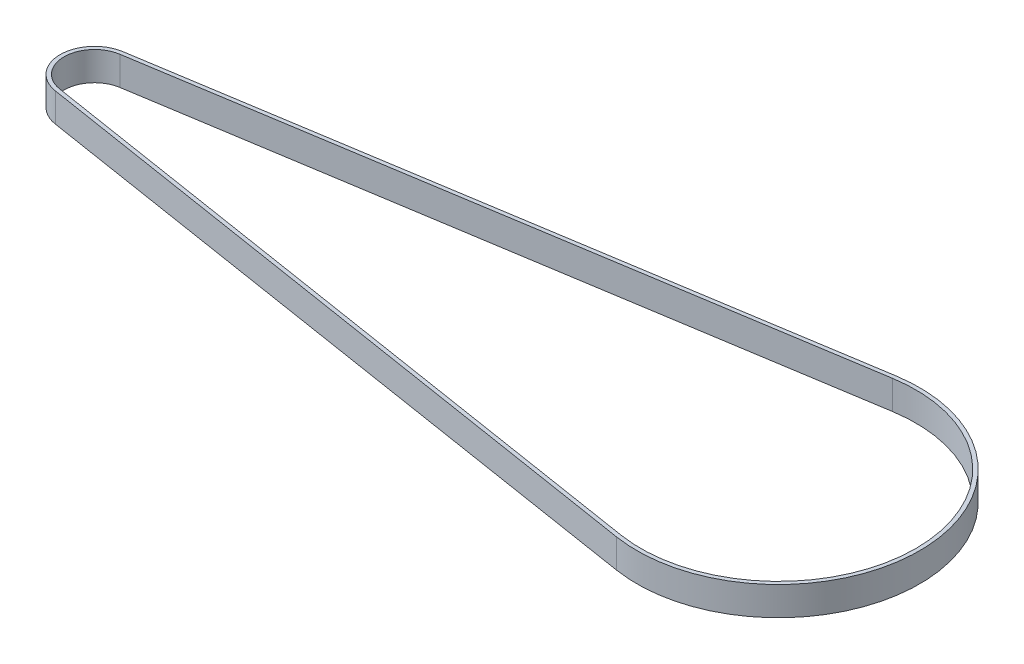
ISO-10303-21;
HEADER;
FILE_DESCRIPTION(('STEP AP214'),'2;1');
FILE_NAME('part.step','',(''),(''),'','','');
FILE_SCHEMA(('AUTOMOTIVE_DESIGN { 1 0 10303 214 1 1 1 1 }'));
ENDSEC;
DATA;
#1=APPLICATION_CONTEXT('core data for automotive mechanical design processes');
#2=APPLICATION_PROTOCOL_DEFINITION('international standard','automotive_design',2000,#1);
#3=PRODUCT_CONTEXT('',#1,'mechanical');
#4=PRODUCT('Part','Part','',(#3));
#5=PRODUCT_RELATED_PRODUCT_CATEGORY('part','',(#4));
#6=PRODUCT_DEFINITION_FORMATION('','',#4);
#7=PRODUCT_DEFINITION_CONTEXT('part definition',#1,'design');
#8=PRODUCT_DEFINITION('design','',#6,#7);
#9=PRODUCT_DEFINITION_SHAPE('','',#8);
#10=(LENGTH_UNIT() NAMED_UNIT(*) SI_UNIT(.MILLI.,.METRE.));
#11=(NAMED_UNIT(*) PLANE_ANGLE_UNIT() SI_UNIT($,.RADIAN.));
#12=(NAMED_UNIT(*) SI_UNIT($,.STERADIAN.) SOLID_ANGLE_UNIT());
#13=UNCERTAINTY_MEASURE_WITH_UNIT(LENGTH_MEASURE(1.E-05),#10,'distance_accuracy_value','');
#14=(GEOMETRIC_REPRESENTATION_CONTEXT(3) GLOBAL_UNCERTAINTY_ASSIGNED_CONTEXT((#13)) GLOBAL_UNIT_ASSIGNED_CONTEXT((#10,
#11,#12)) REPRESENTATION_CONTEXT('',''));
#15=CARTESIAN_POINT('',(0.,0.,0.));
#16=DIRECTION('',(0.,0.,1.));
#17=DIRECTION('',(1.,0.,0.));
#18=AXIS2_PLACEMENT_3D('',#15,#16,#17);
#19=CARTESIAN_POINT('',(-142.5,6.,0.));
#20=DIRECTION('',(0.,1.,0.));
#21=DIRECTION('',(0.,0.,1.));
#22=AXIS2_PLACEMENT_3D('',#19,#20,#21);
#23=PLANE('',#22);
#24=CARTESIAN_POINT('',(-142.5,6.,0.));
#25=DIRECTION('',(0.,1.,0.));
#26=DIRECTION('',(0.,0.,1.));
#27=AXIS2_PLACEMENT_3D('',#24,#25,#26);
#28=CIRCLE('',#27,7.15);
#29=CARTESIAN_POINT('',(-143.618912280702,6.,-7.06190734207797));
#30=VERTEX_POINT('',#29);
#31=CARTESIAN_POINT('',(-143.618912280702,6.,7.06190734207797));
#32=VERTEX_POINT('',#31);
#33=EDGE_CURVE('E133',#30,#32,#28,.T.);
#34=ORIENTED_EDGE('',*,*,#33,.T.);
#35=DIRECTION('',(0.987679348542374,0.,0.156491228070175));
#36=VECTOR('',#35,1.);
#37=CARTESIAN_POINT('',(-143.618912280702,6.,7.06190734207797));
#38=LINE('',#37,#36);
#39=CARTESIAN_POINT('',(-4.60866666666669,6.,29.0871568145729));
#40=VERTEX_POINT('',#39);
#41=EDGE_CURVE('E136',#32,#40,#38,.T.);
#42=ORIENTED_EDGE('',*,*,#41,.T.);
#43=CARTESIAN_POINT('',(0.,6.,0.));
#44=DIRECTION('',(0.,1.,0.));
#45=DIRECTION('',(0.,0.,1.));
#46=AXIS2_PLACEMENT_3D('',#43,#44,#45);
#47=CIRCLE('',#46,29.45);
#48=CARTESIAN_POINT('',(-4.60866666666665,6.,-29.0871568145729));
#49=VERTEX_POINT('',#48);
#50=EDGE_CURVE('E139',#40,#49,#47,.T.);
#51=ORIENTED_EDGE('',*,*,#50,.T.);
#52=DIRECTION('',(-0.987679348542374,0.,0.156491228070176));
#53=VECTOR('',#52,1.);
#54=CARTESIAN_POINT('',(-143.618912280702,6.,-7.06190734207797));
#55=LINE('',#54,#53);
#56=EDGE_CURVE('E141',#49,#30,#55,.T.);
#57=ORIENTED_EDGE('',*,*,#56,.T.);
#58=EDGE_LOOP('',(#34,#42,#51,#57));
#59=FACE_BOUND('',#58,.T.);
#60=DIRECTION('',(0.987679348542374,0.,0.156491228070175));
#61=VECTOR('',#60,1.);
#62=CARTESIAN_POINT('',(-143.493719298246,6.,6.27176386324407));
#63=LINE('',#62,#61);
#64=CARTESIAN_POINT('',(-143.493719298246,6.,6.27176386324407));
#65=VERTEX_POINT('',#64);
#66=CARTESIAN_POINT('',(-4.48347368421053,6.,28.297013335739));
#67=VERTEX_POINT('',#66);
#68=EDGE_CURVE('E105',#65,#67,#63,.T.);
#69=ORIENTED_EDGE('',*,*,#68,.F.);
#70=CARTESIAN_POINT('',(-142.5,6.,0.));
#71=DIRECTION('',(0.,1.,0.));
#72=DIRECTION('',(0.,0.,1.));
#73=AXIS2_PLACEMENT_3D('',#70,#71,#72);
#74=CIRCLE('',#73,6.35);
#75=CARTESIAN_POINT('',(-143.493719298246,6.,-6.27176386324407));
#76=VERTEX_POINT('',#75);
#77=EDGE_CURVE('E97',#76,#65,#74,.T.);
#78=ORIENTED_EDGE('',*,*,#77,.F.);
#79=DIRECTION('',(-0.987679348542374,0.,0.156491228070176));
#80=VECTOR('',#79,1.);
#81=CARTESIAN_POINT('',(-143.493719298246,6.,-6.27176386324407));
#82=LINE('',#81,#80);
#83=CARTESIAN_POINT('',(-4.48347368421051,6.,-28.297013335739));
#84=VERTEX_POINT('',#83);
#85=EDGE_CURVE('E119',#84,#76,#82,.T.);
#86=ORIENTED_EDGE('',*,*,#85,.F.);
#87=CARTESIAN_POINT('',(0.,6.,0.));
#88=DIRECTION('',(0.,1.,0.));
#89=DIRECTION('',(0.,0.,1.));
#90=AXIS2_PLACEMENT_3D('',#87,#88,#89);
#91=CIRCLE('',#90,28.65);
#92=EDGE_CURVE('E117',#67,#84,#91,.T.);
#93=ORIENTED_EDGE('',*,*,#92,.F.);
#94=EDGE_LOOP('',(#69,#78,#86,#93));
#95=FACE_BOUND('',#94,.T.);
#96=ADVANCED_FACE('F32',(#59,#95),#23,.T.);
#97=CARTESIAN_POINT('',(-142.5,0.,0.));
#98=DIRECTION('',(0.,1.,0.));
#99=DIRECTION('',(0.,0.,1.));
#100=AXIS2_PLACEMENT_3D('',#97,#98,#99);
#101=PLANE('',#100);
#102=CARTESIAN_POINT('',(-142.5,0.,0.));
#103=DIRECTION('',(0.,1.,0.));
#104=DIRECTION('',(0.,0.,1.));
#105=AXIS2_PLACEMENT_3D('',#102,#103,#104);
#106=CIRCLE('',#105,7.15);
#107=CARTESIAN_POINT('',(-143.618912280702,0.,-7.06190734207797));
#108=VERTEX_POINT('',#107);
#109=CARTESIAN_POINT('',(-143.618912280702,0.,7.06190734207797));
#110=VERTEX_POINT('',#109);
#111=EDGE_CURVE('E113',#108,#110,#106,.T.);
#112=ORIENTED_EDGE('',*,*,#111,.F.);
#113=DIRECTION('',(-0.987679348542374,0.,0.156491228070176));
#114=VECTOR('',#113,1.);
#115=CARTESIAN_POINT('',(-143.618912280702,0.,-7.06190734207797));
#116=LINE('',#115,#114);
#117=CARTESIAN_POINT('',(-4.60866666666665,0.,-29.0871568145729));
#118=VERTEX_POINT('',#117);
#119=EDGE_CURVE('E137',#118,#108,#116,.T.);
#120=ORIENTED_EDGE('',*,*,#119,.F.);
#121=CARTESIAN_POINT('',(0.,0.,0.));
#122=DIRECTION('',(0.,1.,0.));
#123=DIRECTION('',(0.,0.,1.));
#124=AXIS2_PLACEMENT_3D('',#121,#122,#123);
#125=CIRCLE('',#124,29.45);
#126=CARTESIAN_POINT('',(-4.60866666666669,0.,29.0871568145729));
#127=VERTEX_POINT('',#126);
#128=EDGE_CURVE('E148',#127,#118,#125,.T.);
#129=ORIENTED_EDGE('',*,*,#128,.F.);
#130=DIRECTION('',(0.987679348542374,0.,0.156491228070175));
#131=VECTOR('',#130,1.);
#132=CARTESIAN_POINT('',(-143.618912280702,0.,7.06190734207797));
#133=LINE('',#132,#131);
#134=EDGE_CURVE('E146',#110,#127,#133,.T.);
#135=ORIENTED_EDGE('',*,*,#134,.F.);
#136=EDGE_LOOP('',(#112,#120,#129,#135));
#137=FACE_BOUND('',#136,.T.);
#138=CARTESIAN_POINT('',(-142.5,0.,0.));
#139=DIRECTION('',(0.,1.,0.));
#140=DIRECTION('',(0.,0.,1.));
#141=AXIS2_PLACEMENT_3D('',#138,#139,#140);
#142=CIRCLE('',#141,6.35);
#143=CARTESIAN_POINT('',(-143.493719298246,0.,-6.27176386324407));
#144=VERTEX_POINT('',#143);
#145=CARTESIAN_POINT('',(-143.493719298246,0.,6.27176386324407));
#146=VERTEX_POINT('',#145);
#147=EDGE_CURVE('E55',#144,#146,#142,.T.);
#148=ORIENTED_EDGE('',*,*,#147,.T.);
#149=DIRECTION('',(0.987679348542374,0.,0.156491228070175));
#150=VECTOR('',#149,1.);
#151=CARTESIAN_POINT('',(-143.493719298246,0.,6.27176386324407));
#152=LINE('',#151,#150);
#153=CARTESIAN_POINT('',(-4.48347368421053,0.,28.297013335739));
#154=VERTEX_POINT('',#153);
#155=EDGE_CURVE('E112',#146,#154,#152,.T.);
#156=ORIENTED_EDGE('',*,*,#155,.T.);
#157=CARTESIAN_POINT('',(0.,0.,0.));
#158=DIRECTION('',(0.,1.,0.));
#159=DIRECTION('',(0.,0.,1.));
#160=AXIS2_PLACEMENT_3D('',#157,#158,#159);
#161=CIRCLE('',#160,28.65);
#162=CARTESIAN_POINT('',(-4.48347368421053,0.,-28.297013335739));
#163=VERTEX_POINT('',#162);
#164=EDGE_CURVE('E125',#154,#163,#161,.T.);
#165=ORIENTED_EDGE('',*,*,#164,.T.);
#166=DIRECTION('',(-0.987679348542374,0.,0.156491228070176));
#167=VECTOR('',#166,1.);
#168=CARTESIAN_POINT('',(-143.493719298246,0.,-6.27176386324407));
#169=LINE('',#168,#167);
#170=EDGE_CURVE('E106',#163,#144,#169,.T.);
#171=ORIENTED_EDGE('',*,*,#170,.T.);
#172=EDGE_LOOP('',(#148,#156,#165,#171));
#173=FACE_BOUND('',#172,.T.);
#174=ADVANCED_FACE('F166',(#137,#173),#101,.F.);
#175=CARTESIAN_POINT('',(-142.5,6.,0.));
#176=DIRECTION('',(0.,-1.,0.));
#177=DIRECTION('',(0.,0.,-1.));
#178=AXIS2_PLACEMENT_3D('',#175,#176,#177);
#179=CYLINDRICAL_SURFACE('',#178,7.15);
#180=ORIENTED_EDGE('',*,*,#111,.T.);
#181=DIRECTION('',(0.,-1.,0.));
#182=VECTOR('',#181,1.);
#183=CARTESIAN_POINT('',(-143.618912280702,6.,7.06190734207797));
#184=LINE('',#183,#182);
#185=EDGE_CURVE('E11',#32,#110,#184,.T.);
#186=ORIENTED_EDGE('',*,*,#185,.F.);
#187=ORIENTED_EDGE('',*,*,#33,.F.);
#188=DIRECTION('',(0.,-1.,0.));
#189=VECTOR('',#188,1.);
#190=CARTESIAN_POINT('',(-143.618912280702,6.,-7.06190734207797));
#191=LINE('',#190,#189);
#192=EDGE_CURVE('E143',#30,#108,#191,.T.);
#193=ORIENTED_EDGE('',*,*,#192,.T.);
#194=EDGE_LOOP('',(#180,#186,#187,#193));
#195=FACE_BOUND('',#194,.T.);
#196=ADVANCED_FACE('F34',(#195),#179,.T.);
#197=CARTESIAN_POINT('',(-143.618912280702,6.,7.06190734207797));
#198=DIRECTION('',(0.156491228070175,0.,-0.987679348542374));
#199=DIRECTION('',(-0.987679348542374,0.,-0.156491228070175));
#200=AXIS2_PLACEMENT_3D('',#197,#198,#199);
#201=PLANE('',#200);
#202=ORIENTED_EDGE('',*,*,#134,.T.);
#203=DIRECTION('',(0.,-1.,0.));
#204=VECTOR('',#203,1.);
#205=CARTESIAN_POINT('',(-4.60866666666669,6.,29.0871568145729));
#206=LINE('',#205,#204);
#207=EDGE_CURVE('E40',#40,#127,#206,.T.);
#208=ORIENTED_EDGE('',*,*,#207,.F.);
#209=ORIENTED_EDGE('',*,*,#41,.F.);
#210=ORIENTED_EDGE('',*,*,#185,.T.);
#211=EDGE_LOOP('',(#202,#208,#209,#210));
#212=FACE_BOUND('',#211,.T.);
#213=ADVANCED_FACE('F176',(#212),#201,.F.);
#214=CARTESIAN_POINT('',(0.,6.,0.));
#215=DIRECTION('',(0.,-1.,0.));
#216=DIRECTION('',(0.,0.,-1.));
#217=AXIS2_PLACEMENT_3D('',#214,#215,#216);
#218=CYLINDRICAL_SURFACE('',#217,29.45);
#219=ORIENTED_EDGE('',*,*,#128,.T.);
#220=DIRECTION('',(0.,-1.,0.));
#221=VECTOR('',#220,1.);
#222=CARTESIAN_POINT('',(-4.60866666666665,6.,-29.0871568145729));
#223=LINE('',#222,#221);
#224=EDGE_CURVE('E153',#49,#118,#223,.T.);
#225=ORIENTED_EDGE('',*,*,#224,.F.);
#226=ORIENTED_EDGE('',*,*,#50,.F.);
#227=ORIENTED_EDGE('',*,*,#207,.T.);
#228=EDGE_LOOP('',(#219,#225,#226,#227));
#229=FACE_BOUND('',#228,.T.);
#230=ADVANCED_FACE('F160',(#229),#218,.T.);
#231=CARTESIAN_POINT('',(-143.618912280702,6.,-7.06190734207797));
#232=DIRECTION('',(0.156491228070176,0.,0.987679348542374));
#233=DIRECTION('',(0.987679348542374,0.,-0.156491228070176));
#234=AXIS2_PLACEMENT_3D('',#231,#232,#233);
#235=PLANE('',#234);
#236=ORIENTED_EDGE('',*,*,#119,.T.);
#237=ORIENTED_EDGE('',*,*,#192,.F.);
#238=ORIENTED_EDGE('',*,*,#56,.F.);
#239=ORIENTED_EDGE('',*,*,#224,.T.);
#240=EDGE_LOOP('',(#236,#237,#238,#239));
#241=FACE_BOUND('',#240,.T.);
#242=ADVANCED_FACE('F170',(#241),#235,.F.);
#243=CARTESIAN_POINT('',(-142.5,6.,0.));
#244=DIRECTION('',(0.,-1.,0.));
#245=DIRECTION('',(0.,0.,-1.));
#246=AXIS2_PLACEMENT_3D('',#243,#244,#245);
#247=CYLINDRICAL_SURFACE('',#246,6.35);
#248=ORIENTED_EDGE('',*,*,#147,.F.);
#249=DIRECTION('',(0.,-1.,0.));
#250=VECTOR('',#249,1.);
#251=CARTESIAN_POINT('',(-143.493719298246,6.,-6.27176386324407));
#252=LINE('',#251,#250);
#253=EDGE_CURVE('E101',#76,#144,#252,.T.);
#254=ORIENTED_EDGE('',*,*,#253,.F.);
#255=ORIENTED_EDGE('',*,*,#77,.T.);
#256=DIRECTION('',(0.,-1.,0.));
#257=VECTOR('',#256,1.);
#258=CARTESIAN_POINT('',(-143.493719298246,6.,6.27176386324407));
#259=LINE('',#258,#257);
#260=EDGE_CURVE('E100',#65,#146,#259,.T.);
#261=ORIENTED_EDGE('',*,*,#260,.T.);
#262=EDGE_LOOP('',(#248,#254,#255,#261));
#263=FACE_BOUND('',#262,.T.);
#264=ADVANCED_FACE('F99',(#263),#247,.F.);
#265=CARTESIAN_POINT('',(-143.493719298246,6.,6.27176386324407));
#266=DIRECTION('',(0.156491228070175,0.,-0.987679348542374));
#267=DIRECTION('',(-0.987679348542374,0.,-0.156491228070175));
#268=AXIS2_PLACEMENT_3D('',#265,#266,#267);
#269=PLANE('',#268);
#270=ORIENTED_EDGE('',*,*,#155,.F.);
#271=ORIENTED_EDGE('',*,*,#260,.F.);
#272=ORIENTED_EDGE('',*,*,#68,.T.);
#273=DIRECTION('',(0.,-1.,0.));
#274=VECTOR('',#273,1.);
#275=CARTESIAN_POINT('',(-4.48347368421053,6.,28.297013335739));
#276=LINE('',#275,#274);
#277=EDGE_CURVE('E114',#67,#154,#276,.T.);
#278=ORIENTED_EDGE('',*,*,#277,.T.);
#279=EDGE_LOOP('',(#270,#271,#272,#278));
#280=FACE_BOUND('',#279,.T.);
#281=ADVANCED_FACE('F109',(#280),#269,.T.);
#282=CARTESIAN_POINT('',(0.,6.,0.));
#283=DIRECTION('',(0.,-1.,0.));
#284=DIRECTION('',(0.,0.,-1.));
#285=AXIS2_PLACEMENT_3D('',#282,#283,#284);
#286=CYLINDRICAL_SURFACE('',#285,28.65);
#287=ORIENTED_EDGE('',*,*,#164,.F.);
#288=ORIENTED_EDGE('',*,*,#277,.F.);
#289=ORIENTED_EDGE('',*,*,#92,.T.);
#290=DIRECTION('',(0.,-1.,0.));
#291=VECTOR('',#290,1.);
#292=CARTESIAN_POINT('',(-4.48347368421053,6.,-28.297013335739));
#293=LINE('',#292,#291);
#294=EDGE_CURVE('E47',#84,#163,#293,.T.);
#295=ORIENTED_EDGE('',*,*,#294,.T.);
#296=EDGE_LOOP('',(#287,#288,#289,#295));
#297=FACE_BOUND('',#296,.T.);
#298=ADVANCED_FACE('F199',(#297),#286,.F.);
#299=CARTESIAN_POINT('',(-143.493719298246,6.,-6.27176386324407));
#300=DIRECTION('',(0.156491228070176,0.,0.987679348542374));
#301=DIRECTION('',(0.987679348542374,0.,-0.156491228070176));
#302=AXIS2_PLACEMENT_3D('',#299,#300,#301);
#303=PLANE('',#302);
#304=ORIENTED_EDGE('',*,*,#170,.F.);
#305=ORIENTED_EDGE('',*,*,#294,.F.);
#306=ORIENTED_EDGE('',*,*,#85,.T.);
#307=ORIENTED_EDGE('',*,*,#253,.T.);
#308=EDGE_LOOP('',(#304,#305,#306,#307));
#309=FACE_BOUND('',#308,.T.);
#310=ADVANCED_FACE('F203',(#309),#303,.T.);
#311=CLOSED_SHELL('',(#96,#174,#196,#213,#230,#242,#264,#281,#298,#310));
#312=MANIFOLD_SOLID_BREP('B2',#311);
#313=ADVANCED_BREP_SHAPE_REPRESENTATION('',(#18,#312),#14);
#314=SHAPE_DEFINITION_REPRESENTATION(#9,#313);
ENDSEC;
END-ISO-10303-21;
